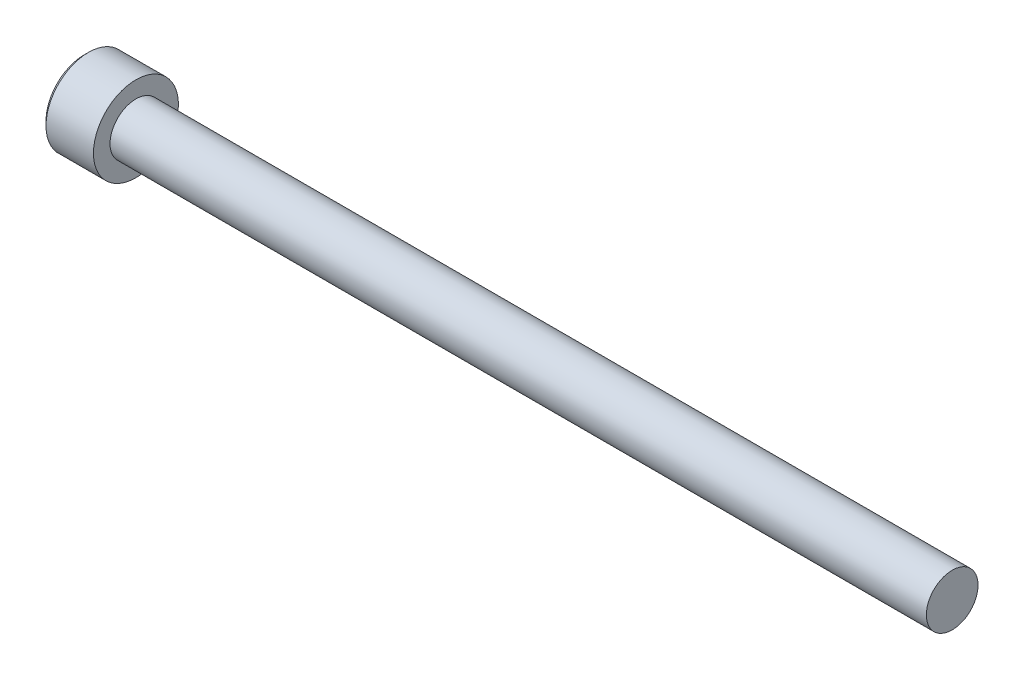
ISO-10303-21;
HEADER;
FILE_DESCRIPTION(('STEP AP214'),'2;1');
FILE_NAME('part.step','',(''),(''),'','','');
FILE_SCHEMA(('AUTOMOTIVE_DESIGN { 1 0 10303 214 1 1 1 1 }'));
ENDSEC;
DATA;
#1=APPLICATION_CONTEXT('core data for automotive mechanical design processes');
#2=APPLICATION_PROTOCOL_DEFINITION('international standard','automotive_design',2000,#1);
#3=PRODUCT_CONTEXT('',#1,'mechanical');
#4=PRODUCT('Part','Part','',(#3));
#5=PRODUCT_RELATED_PRODUCT_CATEGORY('part','',(#4));
#6=PRODUCT_DEFINITION_FORMATION('','',#4);
#7=PRODUCT_DEFINITION_CONTEXT('part definition',#1,'design');
#8=PRODUCT_DEFINITION('design','',#6,#7);
#9=PRODUCT_DEFINITION_SHAPE('','',#8);
#10=(LENGTH_UNIT() NAMED_UNIT(*) SI_UNIT(.MILLI.,.METRE.));
#11=(NAMED_UNIT(*) PLANE_ANGLE_UNIT() SI_UNIT($,.RADIAN.));
#12=(NAMED_UNIT(*) SI_UNIT($,.STERADIAN.) SOLID_ANGLE_UNIT());
#13=UNCERTAINTY_MEASURE_WITH_UNIT(LENGTH_MEASURE(1.E-05),#10,'distance_accuracy_value','');
#14=(GEOMETRIC_REPRESENTATION_CONTEXT(3) GLOBAL_UNCERTAINTY_ASSIGNED_CONTEXT((#13)) GLOBAL_UNIT_ASSIGNED_CONTEXT((#10,
#11,#12)) REPRESENTATION_CONTEXT('',''));
#15=CARTESIAN_POINT('',(0.,0.,0.));
#16=DIRECTION('',(0.,0.,1.));
#17=DIRECTION('',(1.,0.,0.));
#18=AXIS2_PLACEMENT_3D('',#15,#16,#17);
#19=CARTESIAN_POINT('',(-2.28600000000007,-1.14567944042317,1.984375));
#20=DIRECTION('',(0.,0.,1.));
#21=DIRECTION('',(1.,0.,0.));
#22=AXIS2_PLACEMENT_3D('',#19,#20,#21);
#23=PLANE('',#22);
#24=CARTESIAN_POINT('',(-4.82599999995852,1.14567944044653,1.98437499999554));
#25=CARTESIAN_POINT('',(-4.78691618362732,1.06743880343266,1.9843749999984));
#26=CARTESIAN_POINT('',(-4.75011447684892,0.987898318960917,1.98437499999957));
#27=CARTESIAN_POINT('',(-4.68265620500518,0.825677042028778,1.98437500000043));
#28=CARTESIAN_POINT('',(-4.65204056061138,0.742979382529199,1.98437500000012));
#29=CARTESIAN_POINT('',(-4.5991739228306,0.575193959555969,1.98437499999988));
#30=CARTESIAN_POINT('',(-4.57689462080725,0.490115359117279,1.98437499999997));
#31=CARTESIAN_POINT('',(-4.54259467221837,0.318093091130193,1.98437500000003));
#32=CARTESIAN_POINT('',(-4.5305423022885,0.231156054976726,1.984375));
#33=CARTESIAN_POINT('',(-4.52249110263747,0.119918521511051,1.984375));
#34=CARTESIAN_POINT('',(-4.52118947557477,0.0959468443046798,1.984375));
#35=CARTESIAN_POINT('',(-4.51945182629813,0.0479845644411998,1.984375));
#36=CARTESIAN_POINT('',(-4.51901533386223,0.0239939791589393,1.984375));
#37=CARTESIAN_POINT('',(-4.51901809008399,-0.0602201717457363,1.984375));
#38=CARTESIAN_POINT('',(-4.52177452299902,-0.120461721905447,1.984375));
#39=CARTESIAN_POINT('',(-4.5326365512493,-0.240474970989197,1.984375));
#40=CARTESIAN_POINT('',(-4.54074587749718,-0.300246312758427,1.984375));
#41=CARTESIAN_POINT('',(-4.57259622946939,-0.478763752804282,1.984375));
#42=CARTESIAN_POINT('',(-4.60385422611702,-0.596208828937734,1.984375));
#43=CARTESIAN_POINT('',(-4.66780003592237,-0.785921487441256,1.984375));
#44=CARTESIAN_POINT('',(-4.69623457768558,-0.859734609866899,1.984375));
#45=CARTESIAN_POINT('',(-4.75786140400812,-1.00456595519282,1.984375));
#46=CARTESIAN_POINT('',(-4.79100779300359,-1.07560356657101,1.984375));
#47=CARTESIAN_POINT('',(-4.82599999995643,-1.14567944044724,1.984375));
#48=B_SPLINE_CURVE_WITH_KNOTS('',3,(#24,#25,#26,#27,#28,#29,#30,#31,#32,#33,#34,#35,#36,#37,#38,
#39,#40,#41,#42,#43,#44,#45,#46,#47),.UNSPECIFIED.,.F.,.F.,(4,2,2,2,2,2,2,2,2,2,2,4),(0.,
0.262559005207405,0.526801735838036,0.790138824405318,1.05265603861765,1.12466619182083,
1.19663719499031,1.3772702672652,1.55802937209382,1.92104085090328,2.15819130092264,
2.39317265078575),.UNSPECIFIED.);
#49=CARTESIAN_POINT('',(-4.82599999996829,1.14567944041753,1.98437500003084));
#50=VERTEX_POINT('',#49);
#51=CARTESIAN_POINT('',(-4.8259999999622,-1.14567944043207,1.98437500001542));
#52=VERTEX_POINT('',#51);
#53=EDGE_CURVE('E21',#50,#52,#48,.T.);
#54=ORIENTED_EDGE('',*,*,#53,.F.);
#55=DIRECTION('',(1.,0.,0.));
#56=VECTOR('',#55,1.);
#57=CARTESIAN_POINT('',(-2.28600000000007,1.14567944042316,1.984375));
#58=LINE('',#57,#56);
#59=CARTESIAN_POINT('',(-2.28600000000007,1.14567944042316,1.984375));
#60=VERTEX_POINT('',#59);
#61=EDGE_CURVE('E69',#50,#60,#58,.T.);
#62=ORIENTED_EDGE('',*,*,#61,.T.);
#63=DIRECTION('',(0.,1.,0.));
#64=VECTOR('',#63,1.);
#65=CARTESIAN_POINT('',(-2.28600000000007,0.,1.984375));
#66=LINE('',#65,#64);
#67=CARTESIAN_POINT('',(-2.28600000000007,-1.14567944042317,1.984375));
#68=VERTEX_POINT('',#67);
#69=EDGE_CURVE('E75',#68,#60,#66,.T.);
#70=ORIENTED_EDGE('',*,*,#69,.F.);
#71=DIRECTION('',(1.,0.,0.));
#72=VECTOR('',#71,1.);
#73=CARTESIAN_POINT('',(-2.28600000000007,-1.14567944042317,1.984375));
#74=LINE('',#73,#72);
#75=EDGE_CURVE('E72',#68,#52,#74,.F.);
#76=ORIENTED_EDGE('',*,*,#75,.T.);
#77=EDGE_LOOP('',(#54,#62,#70,#76));
#78=FACE_BOUND('',#77,.T.);
#79=ADVANCED_FACE('F17',(#78),#23,.F.);
#80=CARTESIAN_POINT('',(-2.28600000000007,0.,0.));
#81=DIRECTION('',(-1.,0.,0.));
#82=DIRECTION('',(0.,0.,1.));
#83=AXIS2_PLACEMENT_3D('',#80,#81,#82);
#84=PLANE('',#83);
#85=DIRECTION('',(0.,0.5,0.866025403784439));
#86=VECTOR('',#85,1.);
#87=CARTESIAN_POINT('',(-2.28600000000007,2.29135888084633,0.));
#88=LINE('',#87,#86);
#89=CARTESIAN_POINT('',(-2.28600000000007,2.29135888084633,0.));
#90=VERTEX_POINT('',#89);
#91=CARTESIAN_POINT('',(-2.28600000000007,1.14567944042316,-1.984375));
#92=VERTEX_POINT('',#91);
#93=EDGE_CURVE('E83',#90,#92,#88,.F.);
#94=ORIENTED_EDGE('',*,*,#93,.T.);
#95=DIRECTION('',(0.,1.,0.));
#96=VECTOR('',#95,1.);
#97=CARTESIAN_POINT('',(-2.28600000000007,1.14567944042316,-1.984375));
#98=LINE('',#97,#96);
#99=CARTESIAN_POINT('',(-2.28600000000007,-1.14567944042316,-1.984375));
#100=VERTEX_POINT('',#99);
#101=EDGE_CURVE('E243',#92,#100,#98,.F.);
#102=ORIENTED_EDGE('',*,*,#101,.T.);
#103=DIRECTION('',(0.,0.5,-0.866025403784439));
#104=VECTOR('',#103,1.);
#105=CARTESIAN_POINT('',(-2.28600000000007,-1.14567944042316,-1.984375));
#106=LINE('',#105,#104);
#107=CARTESIAN_POINT('',(-2.28600000000007,-2.29135888084633,0.));
#108=VERTEX_POINT('',#107);
#109=EDGE_CURVE('E228',#100,#108,#106,.F.);
#110=ORIENTED_EDGE('',*,*,#109,.T.);
#111=DIRECTION('',(0.,-0.5,-0.866025403784439));
#112=VECTOR('',#111,1.);
#113=CARTESIAN_POINT('',(-2.28600000000007,-2.29135888084633,0.));
#114=LINE('',#113,#112);
#115=EDGE_CURVE('E225',#108,#68,#114,.F.);
#116=ORIENTED_EDGE('',*,*,#115,.T.);
#117=ORIENTED_EDGE('',*,*,#69,.T.);
#118=DIRECTION('',(0.,-0.5,0.866025403784439));
#119=VECTOR('',#118,1.);
#120=CARTESIAN_POINT('',(-2.28600000000007,1.14567944042316,1.984375));
#121=LINE('',#120,#119);
#122=EDGE_CURVE('E82',#60,#90,#121,.F.);
#123=ORIENTED_EDGE('',*,*,#122,.T.);
#124=EDGE_LOOP('',(#94,#102,#110,#116,#117,#123));
#125=FACE_BOUND('',#124,.T.);
#126=ADVANCED_FACE('F161',(#125),#84,.T.);
#127=CARTESIAN_POINT('',(-2.28600000000007,-1.14567944042316,-1.984375));
#128=DIRECTION('',(0.,-0.866025403784439,-0.5));
#129=DIRECTION('',(0.,0.5,-0.866025403784439));
#130=AXIS2_PLACEMENT_3D('',#127,#128,#129);
#131=PLANE('',#130);
#132=CARTESIAN_POINT('',(-4.82599999995871,-1.14567944040756,-1.98437500001887));
#133=CARTESIAN_POINT('',(-4.78666022792997,-1.18505700230148,-1.91617106214563));
#134=CARTESIAN_POINT('',(-4.74963132844072,-1.22509295783734,-1.8468267530301));
#135=CARTESIAN_POINT('',(-4.68183299424977,-1.30673037975396,-1.70542659047317));
#136=CARTESIAN_POINT('',(-4.65110127019237,-1.34833960561553,-1.63335729721673));
#137=CARTESIAN_POINT('',(-4.59845762010516,-1.432242568594,-1.48803310243203));
#138=CARTESIAN_POINT('',(-4.57641341195893,-1.47451494967301,-1.41481519064643));
#139=CARTESIAN_POINT('',(-4.54245011067441,-1.55999007976842,-1.26676792253773));
#140=CARTESIAN_POINT('',(-4.53050567471972,-1.6031902195197,-1.19194308559438));
#141=CARTESIAN_POINT('',(-4.51972842752365,-1.67764765054852,-1.06297903205139));
#142=CARTESIAN_POINT('',(-4.51813352794834,-1.70880881707173,-1.00900630841009));
#143=CARTESIAN_POINT('',(-4.52082392138599,-1.77108016542046,-0.901149169214274));
#144=CARTESIAN_POINT('',(-4.52511127545884,-1.80219032554946,-0.847264791239237));
#145=CARTESIAN_POINT('',(-4.53932219421538,-1.86411684097343,-0.740004920189235));
#146=CARTESIAN_POINT('',(-4.54925206045723,-1.8949328285454,-0.686630064029166));
#147=CARTESIAN_POINT('',(-4.5742029484467,-1.95603190279815,-0.580803363127978));
#148=CARTESIAN_POINT('',(-4.58922357974385,-1.98631503016081,-0.528351447923769));
#149=CARTESIAN_POINT('',(-4.63380478900425,-2.06386502548479,-0.394030915895904));
#150=CARTESIAN_POINT('',(-4.66672213384104,-2.11065153226583,-0.312994309042484));
#151=CARTESIAN_POINT('',(-4.72228952038986,-2.17944749410732,-0.193836207777459));
#152=CARTESIAN_POINT('',(-4.74181309375939,-2.20211890802843,-0.154568166986659));
#153=CARTESIAN_POINT('',(-4.78263970065987,-2.24704195201531,-0.0767591723707469));
#154=CARTESIAN_POINT('',(-4.80394164363173,-2.2692938292399,-0.0382177904539708));
#155=CARTESIAN_POINT('',(-4.82599999995675,-2.29135888085868,2.13931096265935E-11));
#156=B_SPLINE_CURVE_WITH_KNOTS('',3,(#132,#133,#134,#135,#136,#137,#138,#139,#140,#141,#142,
#143,#144,#145,#146,#147,#148,#149,#150,#151,#152,#153,#154,#155),.UNSPECIFIED.,.F.,.F.,(4,2,2,
2,2,2,2,2,2,2,2,4),(0.,0.264284909626495,0.530108996358094,0.791712695414128,1.05265800174404,
1.23942150116703,1.42625045663858,1.61328847394198,1.80031214908683,2.09727151182814,
2.24534838946042,2.39333511890876),.UNSPECIFIED.);
#157=CARTESIAN_POINT('',(-4.8259999999622,-1.14567944043207,-1.98437500001542));
#158=VERTEX_POINT('',#157);
#159=CARTESIAN_POINT('',(-4.82599999996846,-2.2913588808704,-2.00043543490866E-11));
#160=VERTEX_POINT('',#159);
#161=EDGE_CURVE('E163',#158,#160,#156,.T.);
#162=ORIENTED_EDGE('',*,*,#161,.T.);
#163=DIRECTION('',(1.,0.,0.));
#164=VECTOR('',#163,1.);
#165=CARTESIAN_POINT('',(-2.28600000000007,-2.29135888084633,0.));
#166=LINE('',#165,#164);
#167=EDGE_CURVE('E236',#160,#108,#166,.T.);
#168=ORIENTED_EDGE('',*,*,#167,.T.);
#169=ORIENTED_EDGE('',*,*,#109,.F.);
#170=DIRECTION('',(-1.,0.,0.));
#171=VECTOR('',#170,1.);
#172=CARTESIAN_POINT('',(-2.28600000000007,-1.14567944042316,-1.984375));
#173=LINE('',#172,#171);
#174=EDGE_CURVE('E246',#100,#158,#173,.T.);
#175=ORIENTED_EDGE('',*,*,#174,.T.);
#176=EDGE_LOOP('',(#162,#168,#169,#175));
#177=FACE_BOUND('',#176,.T.);
#178=ADVANCED_FACE('F157',(#177),#131,.F.);
#179=CARTESIAN_POINT('',(-2.28600000000007,-2.29135888084633,0.));
#180=DIRECTION('',(0.,-0.866025403784439,0.5));
#181=DIRECTION('',(0.,-0.5,-0.866025403784439));
#182=AXIS2_PLACEMENT_3D('',#179,#180,#181);
#183=PLANE('',#182);
#184=CARTESIAN_POINT('',(-4.8259999999587,-2.29135888085486,-2.29477011545215E-11));
#185=CARTESIAN_POINT('',(-4.78666022792997,-2.25198131896546,0.0682039378529047));
#186=CARTESIAN_POINT('',(-4.74963132844072,-2.21194536343147,0.137548246969502));
#187=CARTESIAN_POINT('',(-4.68183299424977,-2.13030794151622,0.278948409527228));
#188=CARTESIAN_POINT('',(-4.65110127019237,-2.08869871565414,0.351017702783377));
#189=CARTESIAN_POINT('',(-4.59845762010516,-2.00479575267531,0.496341897567867));
#190=CARTESIAN_POINT('',(-4.57641341195893,-1.96252337159644,0.569559809353539));
#191=CARTESIAN_POINT('',(-4.5424501106744,-1.87704824150112,0.717607077462299));
#192=CARTESIAN_POINT('',(-4.53050567471972,-1.8338481017498,0.792431914405622));
#193=CARTESIAN_POINT('',(-4.51972842752365,-1.75939067072096,0.921395967948603));
#194=CARTESIAN_POINT('',(-4.51813352794834,-1.72822950419776,0.975368691589913));
#195=CARTESIAN_POINT('',(-4.52082392138599,-1.66595815584903,1.08322583078573));
#196=CARTESIAN_POINT('',(-4.52511127545884,-1.63484799572003,1.13711020876076));
#197=CARTESIAN_POINT('',(-4.53932219421538,-1.57292148029607,1.24437007981077));
#198=CARTESIAN_POINT('',(-4.54925206045723,-1.54210549272409,1.29774493597084));
#199=CARTESIAN_POINT('',(-4.5742029484467,-1.48100641847134,1.40357163687202));
#200=CARTESIAN_POINT('',(-4.58922357974385,-1.45072329110868,1.45602355207623));
#201=CARTESIAN_POINT('',(-4.63380478900421,-1.37317329578476,1.59034408410398));
#202=CARTESIAN_POINT('',(-4.66672213384095,-1.32638678900379,1.6713806909573));
#203=CARTESIAN_POINT('',(-4.72228952038968,-1.25759082716239,1.79053879222216));
#204=CARTESIAN_POINT('',(-4.74181309375917,-1.23491941324131,1.82980683301291));
#205=CARTESIAN_POINT('',(-4.78263970065959,-1.18999636925449,1.90761582762873));
#206=CARTESIAN_POINT('',(-4.8039416436314,-1.16774449202993,1.94615720954545));
#207=CARTESIAN_POINT('',(-4.82599999995639,-1.14567944041117,1.98437500002077));
#208=B_SPLINE_CURVE_WITH_KNOTS('',3,(#184,#185,#186,#187,#188,#189,#190,#191,#192,#193,#194,
#195,#196,#197,#198,#199,#200,#201,#202,#203,#204,#205,#206,#207),.UNSPECIFIED.,.F.,.F.,(4,2,2,
2,2,2,2,2,2,2,2,4),(0.,0.264284909626493,0.530108996358089,0.791712695414125,1.05265800174404,
1.23942150116703,1.42625045663858,1.61328847394198,1.80031214908683,2.09727151182773,
2.24534838945981,2.39333511890795),.UNSPECIFIED.);
#209=EDGE_CURVE('E92',#160,#52,#208,.T.);
#210=ORIENTED_EDGE('',*,*,#209,.T.);
#211=ORIENTED_EDGE('',*,*,#75,.F.);
#212=ORIENTED_EDGE('',*,*,#115,.F.);
#213=ORIENTED_EDGE('',*,*,#167,.F.);
#214=EDGE_LOOP('',(#210,#211,#212,#213));
#215=FACE_BOUND('',#214,.T.);
#216=ADVANCED_FACE('F152',(#215),#183,.F.);
#217=CARTESIAN_POINT('',(-2.28600000000007,1.14567944042316,1.984375));
#218=DIRECTION('',(0.,0.866025403784439,0.5));
#219=DIRECTION('',(0.,-0.5,0.866025403784439));
#220=AXIS2_PLACEMENT_3D('',#217,#218,#219);
#221=PLANE('',#220);
#222=CARTESIAN_POINT('',(-4.82599999995852,1.14567944040762,1.98437500001801));
#223=CARTESIAN_POINT('',(-4.78666022792973,1.1850570023017,1.91617106214498));
#224=CARTESIAN_POINT('',(-4.74963132844047,1.22509295783761,1.84682675302957));
#225=CARTESIAN_POINT('',(-4.68183299424957,1.30673037975422,1.70542659047278));
#226=CARTESIAN_POINT('',(-4.65110127019222,1.34833960561574,1.63335729721638));
#227=CARTESIAN_POINT('',(-4.59845762010509,1.43224256859413,1.48803310243178));
#228=CARTESIAN_POINT('',(-4.57641341195888,1.47451494967311,1.41481519064625));
#229=CARTESIAN_POINT('',(-4.54245011067439,1.55999007976846,1.26676792253767));
#230=CARTESIAN_POINT('',(-4.53050567471972,1.6031902195197,1.19194308559439));
#231=CARTESIAN_POINT('',(-4.51972842752365,1.67764765054848,1.06297903205146));
#232=CARTESIAN_POINT('',(-4.51813352794835,1.70880881707169,1.00900630841016));
#233=CARTESIAN_POINT('',(-4.52082392138598,1.77108016542041,0.901149169214364));
#234=CARTESIAN_POINT('',(-4.52511127545883,1.80219032554941,0.847264791239333));
#235=CARTESIAN_POINT('',(-4.53932219421536,1.86411684097336,0.740004920189342));
#236=CARTESIAN_POINT('',(-4.54925206045721,1.89493282854533,0.686630064029278));
#237=CARTESIAN_POINT('',(-4.57420294844667,1.95603190279808,0.5808033631281));
#238=CARTESIAN_POINT('',(-4.58922357974382,1.98631503016074,0.528351447923897));
#239=CARTESIAN_POINT('',(-4.6338047890042,2.06386502548473,0.394030915896012));
#240=CARTESIAN_POINT('',(-4.666722133841,2.11065153226578,0.312994309042568));
#241=CARTESIAN_POINT('',(-4.72228952038984,2.17944749410729,0.19383620777751));
#242=CARTESIAN_POINT('',(-4.74181309375937,2.20211890802841,0.1545681669867));
#243=CARTESIAN_POINT('',(-4.78263970065986,2.24704195201529,0.0767591723707674));
#244=CARTESIAN_POINT('',(-4.80394164363172,2.26929382923989,0.0382177904539813));
#245=CARTESIAN_POINT('',(-4.82599999995675,2.29135888085868,-2.1392886942985E-11));
#246=B_SPLINE_CURVE_WITH_KNOTS('',3,(#222,#223,#224,#225,#226,#227,#228,#229,#230,#231,#232,
#233,#234,#235,#236,#237,#238,#239,#240,#241,#242,#243,#244,#245),.UNSPECIFIED.,.F.,.F.,(4,2,2,
2,2,2,2,2,2,2,2,4),(0.,0.26428490962629,0.530108996357672,0.791712695413487,1.05265800174319,
1.23942150116616,1.42625045663768,1.61328847394106,1.80031214908589,2.09727151182728,
2.2453483894596,2.39333511890798),.UNSPECIFIED.);
#247=CARTESIAN_POINT('',(-4.82599999996846,2.29135888087039,2.00042061038936E-11));
#248=VERTEX_POINT('',#247);
#249=EDGE_CURVE('E80',#50,#248,#246,.T.);
#250=ORIENTED_EDGE('',*,*,#249,.T.);
#251=DIRECTION('',(1.,0.,0.));
#252=VECTOR('',#251,1.);
#253=CARTESIAN_POINT('',(-2.28600000000007,2.29135888084633,0.));
#254=LINE('',#253,#252);
#255=EDGE_CURVE('E247',#248,#90,#254,.T.);
#256=ORIENTED_EDGE('',*,*,#255,.T.);
#257=ORIENTED_EDGE('',*,*,#122,.F.);
#258=ORIENTED_EDGE('',*,*,#61,.F.);
#259=EDGE_LOOP('',(#250,#256,#257,#258));
#260=FACE_BOUND('',#259,.T.);
#261=ADVANCED_FACE('F77',(#260),#221,.F.);
#262=CARTESIAN_POINT('',(-2.28600000000007,2.29135888084633,0.));
#263=DIRECTION('',(0.,0.866025403784439,-0.5));
#264=DIRECTION('',(0.,0.5,0.866025403784439));
#265=AXIS2_PLACEMENT_3D('',#262,#263,#264);
#266=PLANE('',#265);
#267=CARTESIAN_POINT('',(-4.82599999995871,2.29135888085486,2.29489280696874E-11));
#268=CARTESIAN_POINT('',(-4.78666022792997,2.25198131896547,-0.0682039378529039));
#269=CARTESIAN_POINT('',(-4.74963132844072,2.21194536343147,-0.137548246969502));
#270=CARTESIAN_POINT('',(-4.68183299424977,2.13030794151622,-0.278948409527229));
#271=CARTESIAN_POINT('',(-4.65110127019237,2.08869871565414,-0.351017702783379));
#272=CARTESIAN_POINT('',(-4.59845762010516,2.00479575267531,-0.496341897567869));
#273=CARTESIAN_POINT('',(-4.57641341195893,1.96252337159644,-0.569559809353541));
#274=CARTESIAN_POINT('',(-4.5424501106744,1.87704824150112,-0.7176070774623));
#275=CARTESIAN_POINT('',(-4.53050567471972,1.8338481017498,-0.792431914405622));
#276=CARTESIAN_POINT('',(-4.51972842752365,1.75939067072096,-0.921395967948603));
#277=CARTESIAN_POINT('',(-4.51813352794834,1.72822950419776,-0.975368691589912));
#278=CARTESIAN_POINT('',(-4.52082392138599,1.66595815584903,-1.08322583078573));
#279=CARTESIAN_POINT('',(-4.52511127545884,1.63484799572003,-1.13711020876076));
#280=CARTESIAN_POINT('',(-4.53932219421538,1.57292148029607,-1.24437007981077));
#281=CARTESIAN_POINT('',(-4.54925206045723,1.54210549272409,-1.29774493597083));
#282=CARTESIAN_POINT('',(-4.5742029484467,1.48100641847134,-1.40357163687202));
#283=CARTESIAN_POINT('',(-4.58922357974385,1.45072329110868,-1.45602355207623));
#284=CARTESIAN_POINT('',(-4.63380478900425,1.3731732957847,-1.5903440841041));
#285=CARTESIAN_POINT('',(-4.66672213384104,1.32638678900366,-1.67138069095752));
#286=CARTESIAN_POINT('',(-4.72228952038986,1.25759082716218,-1.79053879222254));
#287=CARTESIAN_POINT('',(-4.74181309375939,1.23491941324106,-1.82980683301334));
#288=CARTESIAN_POINT('',(-4.78263970065987,1.18999636925419,-1.90761582762925));
#289=CARTESIAN_POINT('',(-4.80394164363173,1.1677444920296,-1.94615720954603));
#290=CARTESIAN_POINT('',(-4.82599999995675,1.14567944041081,-1.98437500002139));
#291=B_SPLINE_CURVE_WITH_KNOTS('',3,(#267,#268,#269,#270,#271,#272,#273,#274,#275,#276,#277,
#278,#279,#280,#281,#282,#283,#284,#285,#286,#287,#288,#289,#290),.UNSPECIFIED.,.F.,.F.,(4,2,2,
2,2,2,2,2,2,2,2,4),(0.,0.264284909626495,0.530108996358093,0.791712695414127,1.05265800174404,
1.23942150116703,1.42625045663858,1.61328847394198,1.80031214908683,2.09727151182814,
2.24534838946042,2.39333511890876),.UNSPECIFIED.);
#292=CARTESIAN_POINT('',(-4.82599999996846,1.14567944045252,-1.98437500001084));
#293=VERTEX_POINT('',#292);
#294=EDGE_CURVE('E40',#248,#293,#291,.T.);
#295=ORIENTED_EDGE('',*,*,#294,.T.);
#296=DIRECTION('',(-1.,0.,0.));
#297=VECTOR('',#296,1.);
#298=CARTESIAN_POINT('',(-2.28600000000007,1.14567944042316,-1.984375));
#299=LINE('',#298,#297);
#300=EDGE_CURVE('E167',#293,#92,#299,.F.);
#301=ORIENTED_EDGE('',*,*,#300,.T.);
#302=ORIENTED_EDGE('',*,*,#93,.F.);
#303=ORIENTED_EDGE('',*,*,#255,.F.);
#304=EDGE_LOOP('',(#295,#301,#302,#303));
#305=FACE_BOUND('',#304,.T.);
#306=ADVANCED_FACE('F151',(#305),#266,.F.);
#307=CARTESIAN_POINT('',(-2.28600000000007,1.14567944042316,-1.984375));
#308=DIRECTION('',(0.,0.,-1.));
#309=DIRECTION('',(-1.,0.,0.));
#310=AXIS2_PLACEMENT_3D('',#307,#308,#309);
#311=PLANE('',#310);
#312=CARTESIAN_POINT('',(-4.8259999999587,1.14567944044731,-1.98437499999592));
#313=CARTESIAN_POINT('',(-4.78666022793094,1.06692431665146,-1.98437499999853));
#314=CARTESIAN_POINT('',(-4.74963132844318,0.986852405569011,-1.98437499999961));
#315=CARTESIAN_POINT('',(-4.6818329942566,0.823577561711963,-1.9843750000004));
#316=CARTESIAN_POINT('',(-4.65110127020207,0.740359109975722,-1.98437500000011));
#317=CARTESIAN_POINT('',(-4.59845762012233,0.572553183993917,-1.9843749999999));
#318=CARTESIAN_POINT('',(-4.57641341198063,0.488008421824127,-1.98437499999997));
#319=CARTESIAN_POINT('',(-4.54245011070673,0.317058161610178,-1.98437500000003));
#320=CARTESIAN_POINT('',(-4.53050567475816,0.230657882096267,-1.98437500000001));
#321=CARTESIAN_POINT('',(-4.51972842757294,0.0817430200124032,-1.984375));
#322=CARTESIAN_POINT('',(-4.51813352800283,0.0194206869508218,-1.984375));
#323=CARTESIAN_POINT('',(-4.52082392145254,-0.1051220097764,-1.984375));
#324=CARTESIAN_POINT('',(-4.52511127553227,-0.167342330049008,-1.984375));
#325=CARTESIAN_POINT('',(-4.53932219430377,-0.291195360925477,-1.984375));
#326=CARTESIAN_POINT('',(-4.54925206055372,-0.352827336083362,-1.984375));
#327=CARTESIAN_POINT('',(-4.57420294856008,-0.475025484616114,-1.984375));
#328=CARTESIAN_POINT('',(-4.58922357986604,-0.535591739354747,-1.984375));
#329=CARTESIAN_POINT('',(-4.63380478912724,-0.690691729958653,-1.984375));
#330=CARTESIAN_POINT('',(-4.66672213394715,-0.784264743465576,-1.984375));
#331=CARTESIAN_POINT('',(-4.7222895204619,-0.921856667069616,-1.984375));
#332=CARTESIAN_POINT('',(-4.74181309381856,-0.967199494886089,-1.984375));
#333=CARTESIAN_POINT('',(-4.78263970069104,-1.05704558280959,-1.984375));
#334=CARTESIAN_POINT('',(-4.80394164364776,-1.10154933723428,-1.984375));
#335=CARTESIAN_POINT('',(-4.82599999995675,-1.14567944044787,-1.984375));
#336=B_SPLINE_CURVE_WITH_KNOTS('',3,(#312,#313,#314,#315,#316,#317,#318,#319,#320,#321,#322,
#323,#324,#325,#326,#327,#328,#329,#330,#331,#332,#333,#334,#335),.UNSPECIFIED.,.F.,.F.,(4,2,2,
2,2,2,2,2,2,2,2,4),(0.,0.264284909658836,0.530108996422784,0.791712695509868,1.0526580018708,
1.23942150133878,1.42625045685537,1.61328847420389,1.80031214939384,2.09727151196384,
2.24534838950992,2.39333511887245),.UNSPECIFIED.);
#337=EDGE_CURVE('E109',#293,#158,#336,.T.);
#338=ORIENTED_EDGE('',*,*,#337,.T.);
#339=ORIENTED_EDGE('',*,*,#174,.F.);
#340=ORIENTED_EDGE('',*,*,#101,.F.);
#341=ORIENTED_EDGE('',*,*,#300,.F.);
#342=EDGE_LOOP('',(#338,#339,#340,#341));
#343=FACE_BOUND('',#342,.T.);
#344=ADVANCED_FACE('F122',(#343),#311,.F.);
#345=CARTESIAN_POINT('',(-4.82599999998001,0.,0.));
#346=DIRECTION('',(-1.,0.,0.));
#347=DIRECTION('',(0.,0.,1.));
#348=AXIS2_PLACEMENT_3D('',#345,#346,#347);
#349=CONICAL_SURFACE('',#348,2.29135888088194,0.785398163397448);
#350=ORIENTED_EDGE('',*,*,#161,.F.);
#351=CARTESIAN_POINT('',(-4.82599999998001,0.,0.));
#352=DIRECTION('',(-1.,0.,0.));
#353=DIRECTION('',(0.,0.,1.));
#354=AXIS2_PLACEMENT_3D('',#351,#352,#353);
#355=CIRCLE('',#354,2.29135888088194);
#356=EDGE_CURVE('E106',#158,#160,#355,.T.);
#357=ORIENTED_EDGE('',*,*,#356,.T.);
#358=EDGE_LOOP('',(#350,#357));
#359=FACE_BOUND('',#358,.T.);
#360=ADVANCED_FACE('F168',(#359),#349,.F.);
#361=CARTESIAN_POINT('',(-4.82599999998001,0.,0.));
#362=DIRECTION('',(-1.,0.,0.));
#363=DIRECTION('',(0.,0.,1.));
#364=AXIS2_PLACEMENT_3D('',#361,#362,#363);
#365=CONICAL_SURFACE('',#364,2.29135888088194,0.785398163397448);
#366=ORIENTED_EDGE('',*,*,#209,.F.);
#367=CARTESIAN_POINT('',(-4.82599999998001,0.,0.));
#368=DIRECTION('',(-1.,0.,0.));
#369=DIRECTION('',(0.,0.,1.));
#370=AXIS2_PLACEMENT_3D('',#367,#368,#369);
#371=CIRCLE('',#370,2.29135888088194);
#372=EDGE_CURVE('E87',#160,#52,#371,.T.);
#373=ORIENTED_EDGE('',*,*,#372,.T.);
#374=EDGE_LOOP('',(#366,#373));
#375=FACE_BOUND('',#374,.T.);
#376=ADVANCED_FACE('F171',(#375),#365,.F.);
#377=CARTESIAN_POINT('',(-4.82599999998001,0.,0.));
#378=DIRECTION('',(-1.,0.,0.));
#379=DIRECTION('',(0.,0.,1.));
#380=AXIS2_PLACEMENT_3D('',#377,#378,#379);
#381=CONICAL_SURFACE('',#380,2.29135888088194,0.78539816348948);
#382=CARTESIAN_POINT('',(-4.82599999998001,0.,0.));
#383=DIRECTION('',(-1.,0.,0.));
#384=DIRECTION('',(0.,0.,1.));
#385=AXIS2_PLACEMENT_3D('',#382,#383,#384);
#386=CIRCLE('',#385,2.29135888088194);
#387=EDGE_CURVE('E60',#52,#50,#386,.T.);
#388=ORIENTED_EDGE('',*,*,#387,.T.);
#389=ORIENTED_EDGE('',*,*,#53,.T.);
#390=EDGE_LOOP('',(#388,#389));
#391=FACE_BOUND('',#390,.T.);
#392=ADVANCED_FACE('F85',(#391),#381,.F.);
#393=CARTESIAN_POINT('',(-4.82599999998001,0.,0.));
#394=DIRECTION('',(-1.,0.,0.));
#395=DIRECTION('',(0.,0.,1.));
#396=AXIS2_PLACEMENT_3D('',#393,#394,#395);
#397=CONICAL_SURFACE('',#396,2.29135888088194,0.785398163397448);
#398=ORIENTED_EDGE('',*,*,#249,.F.);
#399=CARTESIAN_POINT('',(-4.82599999998001,0.,0.));
#400=DIRECTION('',(-1.,0.,0.));
#401=DIRECTION('',(0.,0.,1.));
#402=AXIS2_PLACEMENT_3D('',#399,#400,#401);
#403=CIRCLE('',#402,2.29135888088194);
#404=EDGE_CURVE('E86',#50,#248,#403,.T.);
#405=ORIENTED_EDGE('',*,*,#404,.T.);
#406=EDGE_LOOP('',(#398,#405));
#407=FACE_BOUND('',#406,.T.);
#408=ADVANCED_FACE('F91',(#407),#397,.F.);
#409=CARTESIAN_POINT('',(-4.82599999998001,0.,0.));
#410=DIRECTION('',(-1.,0.,0.));
#411=DIRECTION('',(0.,0.,1.));
#412=AXIS2_PLACEMENT_3D('',#409,#410,#411);
#413=CONICAL_SURFACE('',#412,2.29135888088194,0.785398163397448);
#414=ORIENTED_EDGE('',*,*,#294,.F.);
#415=CARTESIAN_POINT('',(-4.82599999998001,0.,0.));
#416=DIRECTION('',(-1.,0.,0.));
#417=DIRECTION('',(0.,0.,1.));
#418=AXIS2_PLACEMENT_3D('',#415,#416,#417);
#419=CIRCLE('',#418,2.29135888088194);
#420=EDGE_CURVE('E98',#248,#293,#419,.T.);
#421=ORIENTED_EDGE('',*,*,#420,.T.);
#422=EDGE_LOOP('',(#414,#421));
#423=FACE_BOUND('',#422,.T.);
#424=ADVANCED_FACE('F129',(#423),#413,.F.);
#425=CARTESIAN_POINT('',(-4.82599999998001,0.,0.));
#426=DIRECTION('',(-1.,0.,0.));
#427=DIRECTION('',(0.,0.,1.));
#428=AXIS2_PLACEMENT_3D('',#425,#426,#427);
#429=CONICAL_SURFACE('',#428,2.29135888088194,0.785398163489476);
#430=ORIENTED_EDGE('',*,*,#337,.F.);
#431=CARTESIAN_POINT('',(-4.82599999998001,0.,0.));
#432=DIRECTION('',(-1.,0.,0.));
#433=DIRECTION('',(0.,0.,1.));
#434=AXIS2_PLACEMENT_3D('',#431,#432,#433);
#435=CIRCLE('',#434,2.29135888088194);
#436=EDGE_CURVE('E100',#293,#158,#435,.T.);
#437=ORIENTED_EDGE('',*,*,#436,.T.);
#438=EDGE_LOOP('',(#430,#437));
#439=FACE_BOUND('',#438,.T.);
#440=ADVANCED_FACE('F125',(#439),#429,.F.);
#441=CARTESIAN_POINT('',(-4.82600000000007,0.,0.));
#442=DIRECTION('',(1.,0.,0.));
#443=DIRECTION('',(0.,0.,-1.));
#444=AXIS2_PLACEMENT_3D('',#441,#442,#443);
#445=PLANE('',#444);
#446=CARTESIAN_POINT('',(-4.82599999998001,0.,0.));
#447=DIRECTION('',(1.,0.,0.));
#448=DIRECTION('',(0.,0.,-1.));
#449=AXIS2_PLACEMENT_3D('',#446,#447,#448);
#450=CIRCLE('',#449,3.56615999999121);
#451=CARTESIAN_POINT('',(-4.82599999998001,0.,-3.56615999999121));
#452=VERTEX_POINT('',#451);
#453=EDGE_CURVE('E213',#452,#452,#450,.T.);
#454=ORIENTED_EDGE('',*,*,#453,.F.);
#455=EDGE_LOOP('',(#454));
#456=FACE_BOUND('',#455,.T.);
#457=ORIENTED_EDGE('',*,*,#420,.F.);
#458=ORIENTED_EDGE('',*,*,#404,.F.);
#459=ORIENTED_EDGE('',*,*,#387,.F.);
#460=ORIENTED_EDGE('',*,*,#372,.F.);
#461=ORIENTED_EDGE('',*,*,#356,.F.);
#462=ORIENTED_EDGE('',*,*,#436,.F.);
#463=EDGE_LOOP('',(#457,#458,#459,#460,#461,#462));
#464=FACE_BOUND('',#463,.T.);
#465=ADVANCED_FACE('F95',(#456,#464),#445,.F.);
#466=CARTESIAN_POINT('',(-4.42976000010731,0.,0.));
#467=DIRECTION('',(1.,0.,0.));
#468=DIRECTION('',(0.,0.,-1.));
#469=AXIS2_PLACEMENT_3D('',#466,#467,#468);
#470=CONICAL_SURFACE('',#469,3.96239999986392,0.785398163397448);
#471=CARTESIAN_POINT('',(-4.42976000000007,0.,0.));
#472=DIRECTION('',(-1.,0.,0.));
#473=DIRECTION('',(0.,0.,1.));
#474=AXIS2_PLACEMENT_3D('',#471,#472,#473);
#475=CIRCLE('',#474,3.9624);
#476=CARTESIAN_POINT('',(-4.42976000000007,0.,3.9624));
#477=VERTEX_POINT('',#476);
#478=EDGE_CURVE('E210',#477,#477,#475,.F.);
#479=ORIENTED_EDGE('',*,*,#478,.F.);
#480=EDGE_LOOP('',(#479));
#481=FACE_BOUND('',#480,.T.);
#482=ORIENTED_EDGE('',*,*,#453,.T.);
#483=EDGE_LOOP('',(#482));
#484=FACE_BOUND('',#483,.T.);
#485=ADVANCED_FACE('F199',(#481,#484),#470,.T.);
#486=CARTESIAN_POINT('',(-4.82600000000008,0.,0.));
#487=DIRECTION('',(-1.,0.,0.));
#488=DIRECTION('',(0.,0.,1.));
#489=AXIS2_PLACEMENT_3D('',#486,#487,#488);
#490=CYLINDRICAL_SURFACE('',#489,3.9624);
#491=ORIENTED_EDGE('',*,*,#478,.T.);
#492=EDGE_LOOP('',(#491));
#493=FACE_BOUND('',#492,.T.);
#494=CARTESIAN_POINT('',(0.,0.,0.));
#495=DIRECTION('',(-1.,0.,0.));
#496=DIRECTION('',(0.,0.,1.));
#497=AXIS2_PLACEMENT_3D('',#494,#495,#496);
#498=CIRCLE('',#497,3.9624);
#499=CARTESIAN_POINT('',(0.,0.,3.9624));
#500=VERTEX_POINT('',#499);
#501=EDGE_CURVE('E215',#500,#500,#498,.T.);
#502=ORIENTED_EDGE('',*,*,#501,.T.);
#503=EDGE_LOOP('',(#502));
#504=FACE_BOUND('',#503,.T.);
#505=ADVANCED_FACE('F196',(#493,#504),#490,.T.);
#506=CARTESIAN_POINT('',(76.2,0.,0.));
#507=DIRECTION('',(1.,0.,0.));
#508=DIRECTION('',(0.,0.,-1.));
#509=AXIS2_PLACEMENT_3D('',#506,#507,#508);
#510=PLANE('',#509);
#511=CARTESIAN_POINT('',(76.2,0.,0.));
#512=DIRECTION('',(-1.,0.,0.));
#513=DIRECTION('',(0.,0.,1.));
#514=AXIS2_PLACEMENT_3D('',#511,#512,#513);
#515=CIRCLE('',#514,2.413);
#516=CARTESIAN_POINT('',(76.2,0.,2.413));
#517=VERTEX_POINT('',#516);
#518=EDGE_CURVE('E31',#517,#517,#515,.T.);
#519=ORIENTED_EDGE('',*,*,#518,.F.);
#520=EDGE_LOOP('',(#519));
#521=FACE_BOUND('',#520,.T.);
#522=ADVANCED_FACE('F189',(#521),#510,.T.);
#523=CARTESIAN_POINT('',(0.,3.9624,0.));
#524=DIRECTION('',(-1.,0.,0.));
#525=DIRECTION('',(0.,0.,1.));
#526=AXIS2_PLACEMENT_3D('',#523,#524,#525);
#527=PLANE('',#526);
#528=CARTESIAN_POINT('',(0.,0.,0.));
#529=DIRECTION('',(-1.,0.,0.));
#530=DIRECTION('',(0.,0.,1.));
#531=AXIS2_PLACEMENT_3D('',#528,#529,#530);
#532=CIRCLE('',#531,2.413);
#533=CARTESIAN_POINT('',(0.,0.,2.413));
#534=VERTEX_POINT('',#533);
#535=EDGE_CURVE('E11',#534,#534,#532,.F.);
#536=ORIENTED_EDGE('',*,*,#535,.F.);
#537=EDGE_LOOP('',(#536));
#538=FACE_BOUND('',#537,.T.);
#539=ORIENTED_EDGE('',*,*,#501,.F.);
#540=EDGE_LOOP('',(#539));
#541=FACE_BOUND('',#540,.T.);
#542=ADVANCED_FACE('F183',(#538,#541),#527,.F.);
#543=CARTESIAN_POINT('',(76.2,0.,0.));
#544=DIRECTION('',(-1.,0.,0.));
#545=DIRECTION('',(0.,0.,1.));
#546=AXIS2_PLACEMENT_3D('',#543,#544,#545);
#547=CYLINDRICAL_SURFACE('',#546,2.413);
#548=ORIENTED_EDGE('',*,*,#535,.T.);
#549=EDGE_LOOP('',(#548));
#550=FACE_BOUND('',#549,.T.);
#551=ORIENTED_EDGE('',*,*,#518,.T.);
#552=EDGE_LOOP('',(#551));
#553=FACE_BOUND('',#552,.T.);
#554=ADVANCED_FACE('F181',(#550,#553),#547,.T.);
#555=CLOSED_SHELL('',(#79,#126,#178,#216,#261,#306,#344,#360,#376,#392,#408,#424,#440,#465,#485,
#505,#522,#542,#554));
#556=MANIFOLD_SOLID_BREP('B1',#555);
#557=ADVANCED_BREP_SHAPE_REPRESENTATION('',(#18,#556),#14);
#558=SHAPE_DEFINITION_REPRESENTATION(#9,#557);
ENDSEC;
END-ISO-10303-21;
